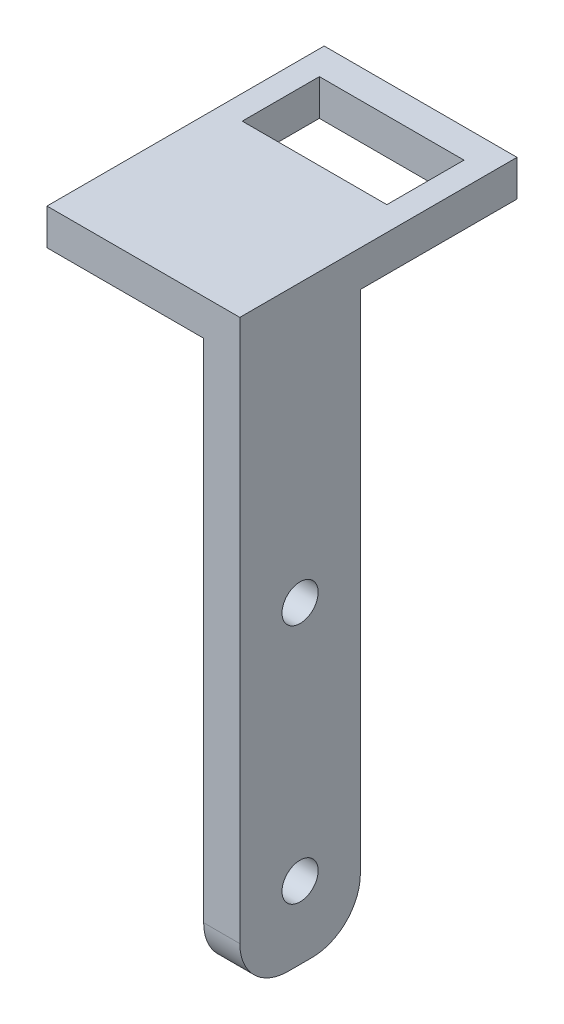
ISO-10303-21;
HEADER;
FILE_DESCRIPTION(('STEP AP214'),'2;1');
FILE_NAME('part.step','',(''),(''),'','','');
FILE_SCHEMA(('AUTOMOTIVE_DESIGN { 1 0 10303 214 1 1 1 1 }'));
ENDSEC;
DATA;
#1=APPLICATION_CONTEXT('core data for automotive mechanical design processes');
#2=APPLICATION_PROTOCOL_DEFINITION('international standard','automotive_design',2000,#1);
#3=PRODUCT_CONTEXT('',#1,'mechanical');
#4=PRODUCT('Part','Part','',(#3));
#5=PRODUCT_RELATED_PRODUCT_CATEGORY('part','',(#4));
#6=PRODUCT_DEFINITION_FORMATION('','',#4);
#7=PRODUCT_DEFINITION_CONTEXT('part definition',#1,'design');
#8=PRODUCT_DEFINITION('design','',#6,#7);
#9=PRODUCT_DEFINITION_SHAPE('','',#8);
#10=(LENGTH_UNIT() NAMED_UNIT(*) SI_UNIT(.MILLI.,.METRE.));
#11=(NAMED_UNIT(*) PLANE_ANGLE_UNIT() SI_UNIT($,.RADIAN.));
#12=(NAMED_UNIT(*) SI_UNIT($,.STERADIAN.) SOLID_ANGLE_UNIT());
#13=UNCERTAINTY_MEASURE_WITH_UNIT(LENGTH_MEASURE(1.E-05),#10,'distance_accuracy_value','');
#14=(GEOMETRIC_REPRESENTATION_CONTEXT(3) GLOBAL_UNCERTAINTY_ASSIGNED_CONTEXT((#13)) GLOBAL_UNIT_ASSIGNED_CONTEXT((#10,
#11,#12)) REPRESENTATION_CONTEXT('',''));
#15=CARTESIAN_POINT('',(0.,0.,0.));
#16=DIRECTION('',(0.,0.,1.));
#17=DIRECTION('',(1.,0.,0.));
#18=AXIS2_PLACEMENT_3D('',#15,#16,#17);
#19=CARTESIAN_POINT('',(4.7625,0.,7.9375));
#20=DIRECTION('',(0.,0.,1.));
#21=DIRECTION('',(1.,0.,0.));
#22=AXIS2_PLACEMENT_3D('',#19,#20,#21);
#23=PLANE('',#22);
#24=DIRECTION('',(0.,1.,0.));
#25=VECTOR('',#24,1.);
#26=CARTESIAN_POINT('',(0.,0.,7.9375));
#27=LINE('',#26,#25);
#28=CARTESIAN_POINT('',(0.,-19.05,7.9375));
#29=VERTEX_POINT('',#28);
#30=CARTESIAN_POINT('',(0.,47.625,7.9375));
#31=VERTEX_POINT('',#30);
#32=EDGE_CURVE('E196',#29,#31,#27,.T.);
#33=ORIENTED_EDGE('',*,*,#32,.F.);
#34=DIRECTION('',(-1.,0.,0.));
#35=VECTOR('',#34,1.);
#36=CARTESIAN_POINT('',(4.7625,-19.05,7.9375));
#37=LINE('',#36,#35);
#38=CARTESIAN_POINT('',(4.7625,-19.05,7.9375));
#39=VERTEX_POINT('',#38);
#40=EDGE_CURVE('E230',#29,#39,#37,.F.);
#41=ORIENTED_EDGE('',*,*,#40,.T.);
#42=DIRECTION('',(0.,1.,0.));
#43=VECTOR('',#42,1.);
#44=CARTESIAN_POINT('',(4.7625,0.,7.9375));
#45=LINE('',#44,#43);
#46=CARTESIAN_POINT('',(4.7625,52.3875,7.9375));
#47=VERTEX_POINT('',#46);
#48=EDGE_CURVE('E197',#39,#47,#45,.T.);
#49=ORIENTED_EDGE('',*,*,#48,.T.);
#50=DIRECTION('',(-1.,0.,0.));
#51=VECTOR('',#50,1.);
#52=CARTESIAN_POINT('',(0.,52.3875,7.9375));
#53=LINE('',#52,#51);
#54=CARTESIAN_POINT('',(-20.6375,52.3875,7.93750000000001));
#55=VERTEX_POINT('',#54);
#56=EDGE_CURVE('E160',#47,#55,#53,.T.);
#57=ORIENTED_EDGE('',*,*,#56,.T.);
#58=DIRECTION('',(0.,-1.,0.));
#59=VECTOR('',#58,1.);
#60=CARTESIAN_POINT('',(-20.6375,52.3875,7.93750000000001));
#61=LINE('',#60,#59);
#62=CARTESIAN_POINT('',(-20.6375,47.625,7.93750000000001));
#63=VERTEX_POINT('',#62);
#64=EDGE_CURVE('E171',#55,#63,#61,.T.);
#65=ORIENTED_EDGE('',*,*,#64,.T.);
#66=DIRECTION('',(-1.,0.,0.));
#67=VECTOR('',#66,1.);
#68=CARTESIAN_POINT('',(0.,47.625,7.9375));
#69=LINE('',#68,#67);
#70=EDGE_CURVE('E157',#31,#63,#69,.T.);
#71=ORIENTED_EDGE('',*,*,#70,.F.);
#72=EDGE_LOOP('',(#33,#41,#49,#57,#65,#71));
#73=FACE_BOUND('',#72,.T.);
#74=ADVANCED_FACE('F36',(#73),#23,.T.);
#75=CARTESIAN_POINT('',(4.7625,-25.4,0.));
#76=DIRECTION('',(0.,1.,0.));
#77=DIRECTION('',(0.,0.,1.));
#78=AXIS2_PLACEMENT_3D('',#75,#76,#77);
#79=PLANE('',#78);
#80=DIRECTION('',(0.,0.,-1.));
#81=VECTOR('',#80,1.);
#82=CARTESIAN_POINT('',(4.7625,-25.4,0.));
#83=LINE('',#82,#81);
#84=CARTESIAN_POINT('',(4.7625,-25.4,1.5875));
#85=VERTEX_POINT('',#84);
#86=CARTESIAN_POINT('',(4.7625,-25.4,-1.5875));
#87=VERTEX_POINT('',#86);
#88=EDGE_CURVE('E199',#85,#87,#83,.T.);
#89=ORIENTED_EDGE('',*,*,#88,.F.);
#90=DIRECTION('',(-1.,0.,0.));
#91=VECTOR('',#90,1.);
#92=CARTESIAN_POINT('',(0.,-25.4,1.5875));
#93=LINE('',#92,#91);
#94=CARTESIAN_POINT('',(0.,-25.4,1.5875));
#95=VERTEX_POINT('',#94);
#96=EDGE_CURVE('E221',#85,#95,#93,.T.);
#97=ORIENTED_EDGE('',*,*,#96,.T.);
#98=DIRECTION('',(0.,0.,-1.));
#99=VECTOR('',#98,1.);
#100=CARTESIAN_POINT('',(0.,-25.4,0.));
#101=LINE('',#100,#99);
#102=CARTESIAN_POINT('',(0.,-25.4,-1.5875));
#103=VERTEX_POINT('',#102);
#104=EDGE_CURVE('E204',#95,#103,#101,.T.);
#105=ORIENTED_EDGE('',*,*,#104,.T.);
#106=DIRECTION('',(-1.,0.,0.));
#107=VECTOR('',#106,1.);
#108=CARTESIAN_POINT('',(4.7625,-25.4,-1.5875));
#109=LINE('',#108,#107);
#110=EDGE_CURVE('E219',#103,#87,#109,.F.);
#111=ORIENTED_EDGE('',*,*,#110,.T.);
#112=EDGE_LOOP('',(#89,#97,#105,#111));
#113=FACE_BOUND('',#112,.T.);
#114=ADVANCED_FACE('F262',(#113),#79,.F.);
#115=CARTESIAN_POINT('',(4.7625,0.,-7.9375));
#116=DIRECTION('',(0.,0.,1.));
#117=DIRECTION('',(1.,0.,0.));
#118=AXIS2_PLACEMENT_3D('',#115,#116,#117);
#119=PLANE('',#118);
#120=DIRECTION('',(0.,1.,0.));
#121=VECTOR('',#120,1.);
#122=CARTESIAN_POINT('',(4.7625,0.,-7.9375));
#123=LINE('',#122,#121);
#124=CARTESIAN_POINT('',(4.7625,-19.05,-7.9375));
#125=VERTEX_POINT('',#124);
#126=CARTESIAN_POINT('',(4.7625,47.625,-7.9375));
#127=VERTEX_POINT('',#126);
#128=EDGE_CURVE('E203',#125,#127,#123,.T.);
#129=ORIENTED_EDGE('',*,*,#128,.F.);
#130=DIRECTION('',(-1.,0.,0.));
#131=VECTOR('',#130,1.);
#132=CARTESIAN_POINT('',(4.7625,-19.05,-7.9375));
#133=LINE('',#132,#131);
#134=CARTESIAN_POINT('',(0.,-19.05,-7.9375));
#135=VERTEX_POINT('',#134);
#136=EDGE_CURVE('E237',#125,#135,#133,.T.);
#137=ORIENTED_EDGE('',*,*,#136,.T.);
#138=DIRECTION('',(0.,1.,0.));
#139=VECTOR('',#138,1.);
#140=CARTESIAN_POINT('',(0.,0.,-7.9375));
#141=LINE('',#140,#139);
#142=CARTESIAN_POINT('',(0.,47.625,-7.9375));
#143=VERTEX_POINT('',#142);
#144=EDGE_CURVE('E207',#135,#143,#141,.T.);
#145=ORIENTED_EDGE('',*,*,#144,.T.);
#146=DIRECTION('',(-1.,0.,0.));
#147=VECTOR('',#146,1.);
#148=CARTESIAN_POINT('',(4.7625,47.625,-7.9375));
#149=LINE('',#148,#147);
#150=EDGE_CURVE('E222',#127,#143,#149,.T.);
#151=ORIENTED_EDGE('',*,*,#150,.F.);
#152=EDGE_LOOP('',(#129,#137,#145,#151));
#153=FACE_BOUND('',#152,.T.);
#154=ADVANCED_FACE('F268',(#153),#119,.F.);
#155=CARTESIAN_POINT('',(4.7625,0.,0.));
#156=DIRECTION('',(1.,0.,0.));
#157=DIRECTION('',(0.,0.,-1.));
#158=AXIS2_PLACEMENT_3D('',#155,#156,#157);
#159=PLANE('',#158);
#160=CARTESIAN_POINT('',(4.7625,-15.875,0.));
#161=DIRECTION('',(1.,0.,0.));
#162=DIRECTION('',(0.,0.,-1.));
#163=AXIS2_PLACEMENT_3D('',#160,#161,#162);
#164=CIRCLE('',#163,2.38124999999999);
#165=CARTESIAN_POINT('',(4.7625,-15.875,-2.38124999999999));
#166=VERTEX_POINT('',#165);
#167=EDGE_CURVE('E184',#166,#166,#164,.T.);
#168=ORIENTED_EDGE('',*,*,#167,.F.);
#169=EDGE_LOOP('',(#168));
#170=FACE_BOUND('',#169,.T.);
#171=CARTESIAN_POINT('',(4.7625,15.875,0.));
#172=DIRECTION('',(1.,0.,0.));
#173=DIRECTION('',(0.,0.,-1.));
#174=AXIS2_PLACEMENT_3D('',#171,#172,#173);
#175=CIRCLE('',#174,2.38124999999999);
#176=CARTESIAN_POINT('',(4.7625,15.875,-2.38124999999999));
#177=VERTEX_POINT('',#176);
#178=EDGE_CURVE('E190',#177,#177,#175,.T.);
#179=ORIENTED_EDGE('',*,*,#178,.F.);
#180=EDGE_LOOP('',(#179));
#181=FACE_BOUND('',#180,.T.);
#182=ORIENTED_EDGE('',*,*,#48,.F.);
#183=CARTESIAN_POINT('',(4.7625,-19.05,1.5875));
#184=DIRECTION('',(1.,0.,0.));
#185=DIRECTION('',(0.,0.,-1.));
#186=AXIS2_PLACEMENT_3D('',#183,#184,#185);
#187=CIRCLE('',#186,6.35);
#188=EDGE_CURVE('E235',#39,#85,#187,.T.);
#189=ORIENTED_EDGE('',*,*,#188,.T.);
#190=ORIENTED_EDGE('',*,*,#88,.T.);
#191=CARTESIAN_POINT('',(4.7625,-19.05,-1.5875));
#192=DIRECTION('',(1.,0.,0.));
#193=DIRECTION('',(0.,0.,-1.));
#194=AXIS2_PLACEMENT_3D('',#191,#192,#193);
#195=CIRCLE('',#194,6.35);
#196=EDGE_CURVE('E232',#87,#125,#195,.T.);
#197=ORIENTED_EDGE('',*,*,#196,.T.);
#198=ORIENTED_EDGE('',*,*,#128,.T.);
#199=DIRECTION('',(0.,0.,-1.));
#200=VECTOR('',#199,1.);
#201=CARTESIAN_POINT('',(4.7625,47.625,0.));
#202=LINE('',#201,#200);
#203=CARTESIAN_POINT('',(4.7625,47.625,-28.575));
#204=VERTEX_POINT('',#203);
#205=EDGE_CURVE('E179',#127,#204,#202,.T.);
#206=ORIENTED_EDGE('',*,*,#205,.T.);
#207=DIRECTION('',(0.,-1.,0.));
#208=VECTOR('',#207,1.);
#209=CARTESIAN_POINT('',(4.7625,52.3875,-28.575));
#210=LINE('',#209,#208);
#211=CARTESIAN_POINT('',(4.7625,52.3875,-28.575));
#212=VERTEX_POINT('',#211);
#213=EDGE_CURVE('E180',#212,#204,#210,.T.);
#214=ORIENTED_EDGE('',*,*,#213,.F.);
#215=DIRECTION('',(0.,0.,-1.));
#216=VECTOR('',#215,1.);
#217=CARTESIAN_POINT('',(4.7625,52.3875,0.));
#218=LINE('',#217,#216);
#219=EDGE_CURVE('E163',#47,#212,#218,.T.);
#220=ORIENTED_EDGE('',*,*,#219,.F.);
#221=EDGE_LOOP('',(#182,#189,#190,#197,#198,#206,#214,#220));
#222=FACE_BOUND('',#221,.T.);
#223=ADVANCED_FACE('F285',(#170,#181,#222),#159,.T.);
#224=CARTESIAN_POINT('',(0.,0.,0.));
#225=DIRECTION('',(1.,0.,0.));
#226=DIRECTION('',(0.,0.,-1.));
#227=AXIS2_PLACEMENT_3D('',#224,#225,#226);
#228=PLANE('',#227);
#229=CARTESIAN_POINT('',(0.,-15.875,0.));
#230=DIRECTION('',(1.,0.,0.));
#231=DIRECTION('',(0.,0.,-1.));
#232=AXIS2_PLACEMENT_3D('',#229,#230,#231);
#233=CIRCLE('',#232,2.38125);
#234=CARTESIAN_POINT('',(0.,-15.875,-2.38125));
#235=VERTEX_POINT('',#234);
#236=EDGE_CURVE('E187',#235,#235,#233,.T.);
#237=ORIENTED_EDGE('',*,*,#236,.T.);
#238=EDGE_LOOP('',(#237));
#239=FACE_BOUND('',#238,.T.);
#240=CARTESIAN_POINT('',(0.,15.875,0.));
#241=DIRECTION('',(1.,0.,0.));
#242=DIRECTION('',(0.,0.,-1.));
#243=AXIS2_PLACEMENT_3D('',#240,#241,#242);
#244=CIRCLE('',#243,2.38125);
#245=CARTESIAN_POINT('',(0.,15.875,-2.38125));
#246=VERTEX_POINT('',#245);
#247=EDGE_CURVE('E193',#246,#246,#244,.T.);
#248=ORIENTED_EDGE('',*,*,#247,.T.);
#249=EDGE_LOOP('',(#248));
#250=FACE_BOUND('',#249,.T.);
#251=ORIENTED_EDGE('',*,*,#104,.F.);
#252=CARTESIAN_POINT('',(0.,-19.05,1.5875));
#253=DIRECTION('',(1.,0.,0.));
#254=DIRECTION('',(0.,0.,-1.));
#255=AXIS2_PLACEMENT_3D('',#252,#253,#254);
#256=CIRCLE('',#255,6.35);
#257=EDGE_CURVE('E228',#95,#29,#256,.F.);
#258=ORIENTED_EDGE('',*,*,#257,.T.);
#259=ORIENTED_EDGE('',*,*,#32,.T.);
#260=DIRECTION('',(0.,0.,-1.));
#261=VECTOR('',#260,1.);
#262=CARTESIAN_POINT('',(0.,47.625,0.));
#263=LINE('',#262,#261);
#264=EDGE_CURVE('E200',#31,#143,#263,.T.);
#265=ORIENTED_EDGE('',*,*,#264,.T.);
#266=ORIENTED_EDGE('',*,*,#144,.F.);
#267=CARTESIAN_POINT('',(0.,-19.05,-1.5875));
#268=DIRECTION('',(1.,0.,0.));
#269=DIRECTION('',(0.,0.,-1.));
#270=AXIS2_PLACEMENT_3D('',#267,#268,#269);
#271=CIRCLE('',#270,6.35);
#272=EDGE_CURVE('E225',#135,#103,#271,.F.);
#273=ORIENTED_EDGE('',*,*,#272,.T.);
#274=EDGE_LOOP('',(#251,#258,#259,#265,#266,#273));
#275=FACE_BOUND('',#274,.T.);
#276=ADVANCED_FACE('F332',(#239,#250,#275),#228,.F.);
#277=CARTESIAN_POINT('',(4.7625,15.875,0.));
#278=DIRECTION('',(1.,0.,0.));
#279=DIRECTION('',(0.,0.,-1.));
#280=AXIS2_PLACEMENT_3D('',#277,#278,#279);
#281=CYLINDRICAL_SURFACE('',#280,2.38124999999999);
#282=ORIENTED_EDGE('',*,*,#247,.F.);
#283=EDGE_LOOP('',(#282));
#284=FACE_BOUND('',#283,.T.);
#285=ORIENTED_EDGE('',*,*,#178,.T.);
#286=EDGE_LOOP('',(#285));
#287=FACE_BOUND('',#286,.T.);
#288=ADVANCED_FACE('F328',(#284,#287),#281,.F.);
#289=CARTESIAN_POINT('',(4.7625,-15.875,0.));
#290=DIRECTION('',(1.,0.,0.));
#291=DIRECTION('',(0.,0.,-1.));
#292=AXIS2_PLACEMENT_3D('',#289,#290,#291);
#293=CYLINDRICAL_SURFACE('',#292,2.38124999999999);
#294=ORIENTED_EDGE('',*,*,#236,.F.);
#295=EDGE_LOOP('',(#294));
#296=FACE_BOUND('',#295,.T.);
#297=ORIENTED_EDGE('',*,*,#167,.T.);
#298=EDGE_LOOP('',(#297));
#299=FACE_BOUND('',#298,.T.);
#300=ADVANCED_FACE('F325',(#296,#299),#293,.F.);
#301=CARTESIAN_POINT('',(0.,52.3875,-28.575));
#302=DIRECTION('',(0.,0.,1.));
#303=DIRECTION('',(1.,0.,0.));
#304=AXIS2_PLACEMENT_3D('',#301,#302,#303);
#305=PLANE('',#304);
#306=DIRECTION('',(-1.,0.,0.));
#307=VECTOR('',#306,1.);
#308=CARTESIAN_POINT('',(0.,47.625,-28.575));
#309=LINE('',#308,#307);
#310=CARTESIAN_POINT('',(-20.6375,47.625,-28.575));
#311=VERTEX_POINT('',#310);
#312=EDGE_CURVE('E183',#204,#311,#309,.T.);
#313=ORIENTED_EDGE('',*,*,#312,.T.);
#314=DIRECTION('',(0.,-1.,0.));
#315=VECTOR('',#314,1.);
#316=CARTESIAN_POINT('',(-20.6375,52.3875,-28.575));
#317=LINE('',#316,#315);
#318=CARTESIAN_POINT('',(-20.6375,52.3875,-28.575));
#319=VERTEX_POINT('',#318);
#320=EDGE_CURVE('E307',#319,#311,#317,.T.);
#321=ORIENTED_EDGE('',*,*,#320,.F.);
#322=DIRECTION('',(-1.,0.,0.));
#323=VECTOR('',#322,1.);
#324=CARTESIAN_POINT('',(0.,52.3875,-28.575));
#325=LINE('',#324,#323);
#326=EDGE_CURVE('E166',#212,#319,#325,.T.);
#327=ORIENTED_EDGE('',*,*,#326,.F.);
#328=ORIENTED_EDGE('',*,*,#213,.T.);
#329=EDGE_LOOP('',(#313,#321,#327,#328));
#330=FACE_BOUND('',#329,.T.);
#331=ADVANCED_FACE('F305',(#330),#305,.F.);
#332=CARTESIAN_POINT('',(-20.6375,52.3875,0.));
#333=DIRECTION('',(-1.,0.,0.));
#334=DIRECTION('',(0.,0.,1.));
#335=AXIS2_PLACEMENT_3D('',#332,#333,#334);
#336=PLANE('',#335);
#337=DIRECTION('',(0.,0.,-1.));
#338=VECTOR('',#337,1.);
#339=CARTESIAN_POINT('',(-20.6375,47.625,0.));
#340=LINE('',#339,#338);
#341=EDGE_CURVE('E164',#63,#311,#340,.T.);
#342=ORIENTED_EDGE('',*,*,#341,.F.);
#343=ORIENTED_EDGE('',*,*,#64,.F.);
#344=DIRECTION('',(0.,0.,-1.));
#345=VECTOR('',#344,1.);
#346=CARTESIAN_POINT('',(-20.6375,52.3875,0.));
#347=LINE('',#346,#345);
#348=EDGE_CURVE('E168',#55,#319,#347,.T.);
#349=ORIENTED_EDGE('',*,*,#348,.T.);
#350=ORIENTED_EDGE('',*,*,#320,.T.);
#351=EDGE_LOOP('',(#342,#343,#349,#350));
#352=FACE_BOUND('',#351,.T.);
#353=ADVANCED_FACE('F314',(#352),#336,.T.);
#354=CARTESIAN_POINT('',(0.,52.3875,0.));
#355=DIRECTION('',(0.,1.,0.));
#356=DIRECTION('',(0.,0.,1.));
#357=AXIS2_PLACEMENT_3D('',#354,#355,#356);
#358=PLANE('',#357);
#359=DIRECTION('',(0.,0.,1.));
#360=VECTOR('',#359,1.);
#361=CARTESIAN_POINT('',(-17.4625,52.3875,-14.605));
#362=LINE('',#361,#360);
#363=CARTESIAN_POINT('',(-17.4625,52.3875,-24.765));
#364=VERTEX_POINT('',#363);
#365=CARTESIAN_POINT('',(-17.4625,52.3875,-14.605));
#366=VERTEX_POINT('',#365);
#367=EDGE_CURVE('E51',#364,#366,#362,.T.);
#368=ORIENTED_EDGE('',*,*,#367,.F.);
#369=DIRECTION('',(-1.,0.,0.));
#370=VECTOR('',#369,1.);
#371=CARTESIAN_POINT('',(-17.4625,52.3875,-24.765));
#372=LINE('',#371,#370);
#373=CARTESIAN_POINT('',(1.5875,52.3875,-24.765));
#374=VERTEX_POINT('',#373);
#375=EDGE_CURVE('E150',#374,#364,#372,.T.);
#376=ORIENTED_EDGE('',*,*,#375,.F.);
#377=DIRECTION('',(0.,0.,-1.));
#378=VECTOR('',#377,1.);
#379=CARTESIAN_POINT('',(1.5875,52.3875,-14.605));
#380=LINE('',#379,#378);
#381=CARTESIAN_POINT('',(1.5875,52.3875,-14.605));
#382=VERTEX_POINT('',#381);
#383=EDGE_CURVE('E134',#382,#374,#380,.T.);
#384=ORIENTED_EDGE('',*,*,#383,.F.);
#385=DIRECTION('',(1.,0.,0.));
#386=VECTOR('',#385,1.);
#387=CARTESIAN_POINT('',(-17.4625,52.3875,-14.605));
#388=LINE('',#387,#386);
#389=EDGE_CURVE('E143',#366,#382,#388,.T.);
#390=ORIENTED_EDGE('',*,*,#389,.F.);
#391=EDGE_LOOP('',(#368,#376,#384,#390));
#392=FACE_BOUND('',#391,.T.);
#393=ORIENTED_EDGE('',*,*,#56,.F.);
#394=ORIENTED_EDGE('',*,*,#219,.T.);
#395=ORIENTED_EDGE('',*,*,#326,.T.);
#396=ORIENTED_EDGE('',*,*,#348,.F.);
#397=EDGE_LOOP('',(#393,#394,#395,#396));
#398=FACE_BOUND('',#397,.T.);
#399=ADVANCED_FACE('F147',(#392,#398),#358,.T.);
#400=CARTESIAN_POINT('',(0.,47.625,0.));
#401=DIRECTION('',(0.,1.,0.));
#402=DIRECTION('',(0.,0.,1.));
#403=AXIS2_PLACEMENT_3D('',#400,#401,#402);
#404=PLANE('',#403);
#405=DIRECTION('',(-1.,0.,0.));
#406=VECTOR('',#405,1.);
#407=CARTESIAN_POINT('',(0.,47.625,-24.765));
#408=LINE('',#407,#406);
#409=CARTESIAN_POINT('',(1.5875,47.625,-24.765));
#410=VERTEX_POINT('',#409);
#411=CARTESIAN_POINT('',(-17.4625,47.625,-24.765));
#412=VERTEX_POINT('',#411);
#413=EDGE_CURVE('E44',#410,#412,#408,.T.);
#414=ORIENTED_EDGE('',*,*,#413,.T.);
#415=DIRECTION('',(0.,0.,1.));
#416=VECTOR('',#415,1.);
#417=CARTESIAN_POINT('',(-17.4625,47.625,0.));
#418=LINE('',#417,#416);
#419=CARTESIAN_POINT('',(-17.4625,47.625,-14.605));
#420=VERTEX_POINT('',#419);
#421=EDGE_CURVE('E11',#412,#420,#418,.T.);
#422=ORIENTED_EDGE('',*,*,#421,.T.);
#423=DIRECTION('',(1.,0.,0.));
#424=VECTOR('',#423,1.);
#425=CARTESIAN_POINT('',(0.,47.625,-14.605));
#426=LINE('',#425,#424);
#427=CARTESIAN_POINT('',(1.5875,47.625,-14.605));
#428=VERTEX_POINT('',#427);
#429=EDGE_CURVE('E240',#420,#428,#426,.T.);
#430=ORIENTED_EDGE('',*,*,#429,.T.);
#431=DIRECTION('',(0.,0.,-1.));
#432=VECTOR('',#431,1.);
#433=CARTESIAN_POINT('',(1.5875,47.625,0.));
#434=LINE('',#433,#432);
#435=EDGE_CURVE('E137',#428,#410,#434,.T.);
#436=ORIENTED_EDGE('',*,*,#435,.T.);
#437=EDGE_LOOP('',(#414,#422,#430,#436));
#438=FACE_BOUND('',#437,.T.);
#439=ORIENTED_EDGE('',*,*,#264,.F.);
#440=ORIENTED_EDGE('',*,*,#70,.T.);
#441=ORIENTED_EDGE('',*,*,#341,.T.);
#442=ORIENTED_EDGE('',*,*,#312,.F.);
#443=ORIENTED_EDGE('',*,*,#205,.F.);
#444=ORIENTED_EDGE('',*,*,#150,.T.);
#445=EDGE_LOOP('',(#439,#440,#441,#442,#443,#444));
#446=FACE_BOUND('',#445,.T.);
#447=ADVANCED_FACE('F244',(#438,#446),#404,.F.);
#448=CARTESIAN_POINT('',(4.7625,-19.05,1.5875));
#449=DIRECTION('',(1.,0.,0.));
#450=DIRECTION('',(0.,0.,-1.));
#451=AXIS2_PLACEMENT_3D('',#448,#449,#450);
#452=CYLINDRICAL_SURFACE('',#451,6.35);
#453=ORIENTED_EDGE('',*,*,#188,.F.);
#454=ORIENTED_EDGE('',*,*,#40,.F.);
#455=ORIENTED_EDGE('',*,*,#257,.F.);
#456=ORIENTED_EDGE('',*,*,#96,.F.);
#457=EDGE_LOOP('',(#453,#454,#455,#456));
#458=FACE_BOUND('',#457,.T.);
#459=ADVANCED_FACE('F257',(#458),#452,.T.);
#460=CARTESIAN_POINT('',(4.7625,-19.05,-1.5875));
#461=DIRECTION('',(-1.,0.,0.));
#462=DIRECTION('',(0.,0.,1.));
#463=AXIS2_PLACEMENT_3D('',#460,#461,#462);
#464=CYLINDRICAL_SURFACE('',#463,6.35);
#465=ORIENTED_EDGE('',*,*,#196,.F.);
#466=ORIENTED_EDGE('',*,*,#110,.F.);
#467=ORIENTED_EDGE('',*,*,#272,.F.);
#468=ORIENTED_EDGE('',*,*,#136,.F.);
#469=EDGE_LOOP('',(#465,#466,#467,#468));
#470=FACE_BOUND('',#469,.T.);
#471=ADVANCED_FACE('F38',(#470),#464,.T.);
#472=CARTESIAN_POINT('',(-17.4625,-25.4,-14.605));
#473=DIRECTION('',(-1.,0.,0.));
#474=DIRECTION('',(0.,0.,1.));
#475=AXIS2_PLACEMENT_3D('',#472,#473,#474);
#476=PLANE('',#475);
#477=DIRECTION('',(0.,1.,0.));
#478=VECTOR('',#477,1.);
#479=CARTESIAN_POINT('',(-17.4625,-25.4,-24.765));
#480=LINE('',#479,#478);
#481=EDGE_CURVE('E155',#412,#364,#480,.T.);
#482=ORIENTED_EDGE('',*,*,#481,.T.);
#483=ORIENTED_EDGE('',*,*,#367,.T.);
#484=DIRECTION('',(0.,1.,0.));
#485=VECTOR('',#484,1.);
#486=CARTESIAN_POINT('',(-17.4625,-25.4,-14.605));
#487=LINE('',#486,#485);
#488=EDGE_CURVE('E140',#420,#366,#487,.T.);
#489=ORIENTED_EDGE('',*,*,#488,.F.);
#490=ORIENTED_EDGE('',*,*,#421,.F.);
#491=EDGE_LOOP('',(#482,#483,#489,#490));
#492=FACE_BOUND('',#491,.T.);
#493=ADVANCED_FACE('F249',(#492),#476,.F.);
#494=CARTESIAN_POINT('',(-17.4625,-25.4,-24.765));
#495=DIRECTION('',(0.,0.,-1.));
#496=DIRECTION('',(-1.,0.,0.));
#497=AXIS2_PLACEMENT_3D('',#494,#495,#496);
#498=PLANE('',#497);
#499=DIRECTION('',(0.,1.,0.));
#500=VECTOR('',#499,1.);
#501=CARTESIAN_POINT('',(1.5875,-25.4,-24.765));
#502=LINE('',#501,#500);
#503=EDGE_CURVE('E139',#410,#374,#502,.T.);
#504=ORIENTED_EDGE('',*,*,#503,.T.);
#505=ORIENTED_EDGE('',*,*,#375,.T.);
#506=ORIENTED_EDGE('',*,*,#481,.F.);
#507=ORIENTED_EDGE('',*,*,#413,.F.);
#508=EDGE_LOOP('',(#504,#505,#506,#507));
#509=FACE_BOUND('',#508,.T.);
#510=ADVANCED_FACE('F248',(#509),#498,.F.);
#511=CARTESIAN_POINT('',(1.5875,-25.4,-14.605));
#512=DIRECTION('',(1.,0.,0.));
#513=DIRECTION('',(0.,0.,-1.));
#514=AXIS2_PLACEMENT_3D('',#511,#512,#513);
#515=PLANE('',#514);
#516=DIRECTION('',(0.,1.,0.));
#517=VECTOR('',#516,1.);
#518=CARTESIAN_POINT('',(1.5875,-25.4,-14.605));
#519=LINE('',#518,#517);
#520=EDGE_CURVE('E59',#428,#382,#519,.T.);
#521=ORIENTED_EDGE('',*,*,#520,.T.);
#522=ORIENTED_EDGE('',*,*,#383,.T.);
#523=ORIENTED_EDGE('',*,*,#503,.F.);
#524=ORIENTED_EDGE('',*,*,#435,.F.);
#525=EDGE_LOOP('',(#521,#522,#523,#524));
#526=FACE_BOUND('',#525,.T.);
#527=ADVANCED_FACE('F131',(#526),#515,.F.);
#528=CARTESIAN_POINT('',(-17.4625,-25.4,-14.605));
#529=DIRECTION('',(0.,0.,1.));
#530=DIRECTION('',(1.,0.,0.));
#531=AXIS2_PLACEMENT_3D('',#528,#529,#530);
#532=PLANE('',#531);
#533=ORIENTED_EDGE('',*,*,#488,.T.);
#534=ORIENTED_EDGE('',*,*,#389,.T.);
#535=ORIENTED_EDGE('',*,*,#520,.F.);
#536=ORIENTED_EDGE('',*,*,#429,.F.);
#537=EDGE_LOOP('',(#533,#534,#535,#536));
#538=FACE_BOUND('',#537,.T.);
#539=ADVANCED_FACE('F144',(#538),#532,.F.);
#540=CLOSED_SHELL('',(#74,#114,#154,#223,#276,#288,#300,#331,#353,#399,#447,#459,#471,#493,#510,
#527,#539));
#541=MANIFOLD_SOLID_BREP('B2',#540);
#542=ADVANCED_BREP_SHAPE_REPRESENTATION('',(#18,#541),#14);
#543=SHAPE_DEFINITION_REPRESENTATION(#9,#542);
ENDSEC;
END-ISO-10303-21;
